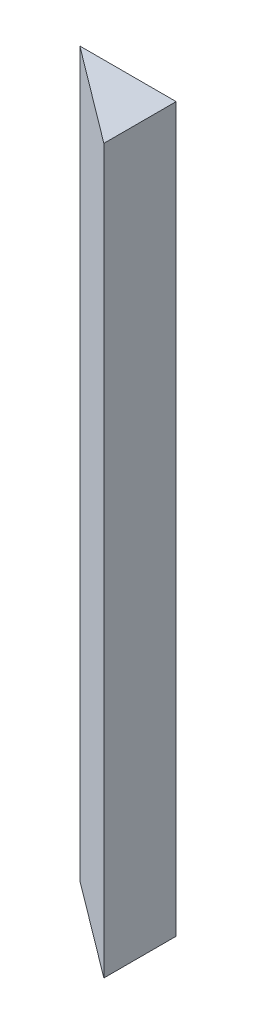
ISO-10303-21;
HEADER;
FILE_DESCRIPTION(('STEP AP214'),'2;1');
FILE_NAME('part.step','',(''),(''),'','','');
FILE_SCHEMA(('AUTOMOTIVE_DESIGN { 1 0 10303 214 1 1 1 1 }'));
ENDSEC;
DATA;
#1=APPLICATION_CONTEXT('core data for automotive mechanical design processes');
#2=APPLICATION_PROTOCOL_DEFINITION('international standard','automotive_design',2000,#1);
#3=PRODUCT_CONTEXT('',#1,'mechanical');
#4=PRODUCT('Part','Part','',(#3));
#5=PRODUCT_RELATED_PRODUCT_CATEGORY('part','',(#4));
#6=PRODUCT_DEFINITION_FORMATION('','',#4);
#7=PRODUCT_DEFINITION_CONTEXT('part definition',#1,'design');
#8=PRODUCT_DEFINITION('design','',#6,#7);
#9=PRODUCT_DEFINITION_SHAPE('','',#8);
#10=(LENGTH_UNIT() NAMED_UNIT(*) SI_UNIT(.MILLI.,.METRE.));
#11=(NAMED_UNIT(*) PLANE_ANGLE_UNIT() SI_UNIT($,.RADIAN.));
#12=(NAMED_UNIT(*) SI_UNIT($,.STERADIAN.) SOLID_ANGLE_UNIT());
#13=UNCERTAINTY_MEASURE_WITH_UNIT(LENGTH_MEASURE(1.E-05),#10,'distance_accuracy_value','');
#14=(GEOMETRIC_REPRESENTATION_CONTEXT(3) GLOBAL_UNCERTAINTY_ASSIGNED_CONTEXT((#13)) GLOBAL_UNIT_ASSIGNED_CONTEXT((#10,
#11,#12)) REPRESENTATION_CONTEXT('',''));
#15=CARTESIAN_POINT('',(0.,0.,0.));
#16=DIRECTION('',(0.,0.,1.));
#17=DIRECTION('',(1.,0.,0.));
#18=AXIS2_PLACEMENT_3D('',#15,#16,#17);
#19=CARTESIAN_POINT('',(3.90666097759886,-0.750000386406215,-2.35778256416098));
#20=DIRECTION('',(1.74845553146952E-07,1.,-8.74227765734759E-08));
#21=DIRECTION('',(-1.,1.74845553146952E-07,0.));
#22=AXIS2_PLACEMENT_3D('',#19,#20,#21);
#23=PLANE('',#22);
#24=DIRECTION('',(0.799759704949034,-8.73527640579341E-08,0.600320259811233));
#25=VECTOR('',#24,1.);
#26=CARTESIAN_POINT('',(3.76677769422186,-0.750000361365912,-2.35112145542898));
#27=LINE('',#26,#25);
#28=CARTESIAN_POINT('',(3.76677769422186,-0.750000361367912,-2.35112145542898));
#29=VERTEX_POINT('',#28);
#30=CARTESIAN_POINT('',(3.89999986886586,-0.750000375918939,-2.25112145542898));
#31=VERTEX_POINT('',#30);
#32=EDGE_CURVE('E11',#29,#31,#27,.T.);
#33=ORIENTED_EDGE('',*,*,#32,.T.);
#34=DIRECTION('',(0.,-8.74227767955201E-08,-0.999999999999996));
#35=VECTOR('',#34,1.);
#36=CARTESIAN_POINT('',(3.89999986886586,-0.750000375916939,-2.25112145542898));
#37=LINE('',#36,#35);
#38=CARTESIAN_POINT('',(3.89999986886586,-0.750000384661217,-2.35112145542898));
#39=VERTEX_POINT('',#38);
#40=EDGE_CURVE('E49',#31,#39,#37,.T.);
#41=ORIENTED_EDGE('',*,*,#40,.T.);
#42=DIRECTION('',(-0.999999999999985,1.74845553322982E-07,0.));
#43=VECTOR('',#42,1.);
#44=CARTESIAN_POINT('',(3.89999986886586,-0.750000384659217,-2.35112145542898));
#45=LINE('',#44,#43);
#46=EDGE_CURVE('E47',#39,#29,#45,.T.);
#47=ORIENTED_EDGE('',*,*,#46,.T.);
#48=EDGE_LOOP('',(#33,#41,#47));
#49=FACE_BOUND('',#48,.T.);
#50=ADVANCED_FACE('F17',(#49),#23,.T.);
#51=CARTESIAN_POINT('',(3.90666080275331,-1.75000038640721,-2.35778247673821));
#52=DIRECTION('',(1.74845553146952E-07,1.,-8.74227765734759E-08));
#53=DIRECTION('',(-1.,1.74845553146952E-07,0.));
#54=AXIS2_PLACEMENT_3D('',#51,#52,#53);
#55=PLANE('',#54);
#56=DIRECTION('',(-0.999999999999985,1.74845553322983E-07,0.));
#57=VECTOR('',#56,1.);
#58=CARTESIAN_POINT('',(3.89999969402031,-1.75000038466022,-2.35112136800621));
#59=LINE('',#58,#57);
#60=CARTESIAN_POINT('',(3.89999969402031,-1.75000038465922,-2.35112136800621));
#61=VERTEX_POINT('',#60);
#62=CARTESIAN_POINT('',(3.76677751937631,-1.75000036136591,-2.35112136800621));
#63=VERTEX_POINT('',#62);
#64=EDGE_CURVE('E24',#61,#63,#59,.T.);
#65=ORIENTED_EDGE('',*,*,#64,.F.);
#66=DIRECTION('',(0.,-8.74227756852966E-08,-0.999999999999996));
#67=VECTOR('',#66,1.);
#68=CARTESIAN_POINT('',(3.89999969402031,-1.75000037591794,-2.2511213680062));
#69=LINE('',#68,#67);
#70=CARTESIAN_POINT('',(3.89999969402031,-1.75000037591694,-2.2511213680062));
#71=VERTEX_POINT('',#70);
#72=EDGE_CURVE('E53',#71,#61,#69,.T.);
#73=ORIENTED_EDGE('',*,*,#72,.F.);
#74=DIRECTION('',(0.799759704949032,-8.73527633914448E-08,0.600320259811236));
#75=VECTOR('',#74,1.);
#76=CARTESIAN_POINT('',(3.76677751937631,-1.75000036136691,-2.35112136800621));
#77=LINE('',#76,#75);
#78=EDGE_CURVE('E68',#63,#71,#77,.T.);
#79=ORIENTED_EDGE('',*,*,#78,.F.);
#80=EDGE_LOOP('',(#65,#73,#79));
#81=FACE_BOUND('',#80,.T.);
#82=ADVANCED_FACE('F73',(#81),#55,.F.);
#83=CARTESIAN_POINT('',(3.76677769422186,-0.750000361365912,-2.35112145542898));
#84=DIRECTION('',(0.600320259811229,-1.74880541890246E-07,-0.799759704949033));
#85=DIRECTION('',(0.799759704949042,-8.73527640504488E-08,0.600320259811241));
#86=AXIS2_PLACEMENT_3D('',#83,#84,#85);
#87=PLANE('',#86);
#88=DIRECTION('',(-1.74845553146773E-07,-0.999999999999981,8.74227765733867E-08));
#89=VECTOR('',#88,1.);
#90=CARTESIAN_POINT('',(3.76677769422186,-0.750000361365912,-2.35112145542898));
#91=LINE('',#90,#89);
#92=EDGE_CURVE('E59',#29,#63,#91,.T.);
#93=ORIENTED_EDGE('',*,*,#92,.T.);
#94=ORIENTED_EDGE('',*,*,#78,.T.);
#95=DIRECTION('',(-1.74845553146773E-07,-0.999999999999981,8.74227765733867E-08));
#96=VECTOR('',#95,1.);
#97=CARTESIAN_POINT('',(3.89999986886586,-0.750000375916939,-2.25112145542898));
#98=LINE('',#97,#96);
#99=EDGE_CURVE('E54',#31,#71,#98,.T.);
#100=ORIENTED_EDGE('',*,*,#99,.F.);
#101=ORIENTED_EDGE('',*,*,#32,.F.);
#102=EDGE_LOOP('',(#93,#94,#100,#101));
#103=FACE_BOUND('',#102,.T.);
#104=ADVANCED_FACE('F57',(#103),#87,.F.);
#105=CARTESIAN_POINT('',(3.89999986886586,-0.750000375916939,-2.25112145542898));
#106=DIRECTION('',(-1.,1.74845553146952E-07,0.));
#107=DIRECTION('',(0.,-8.74227765734759E-08,-1.));
#108=AXIS2_PLACEMENT_3D('',#105,#106,#107);
#109=PLANE('',#108);
#110=ORIENTED_EDGE('',*,*,#99,.T.);
#111=ORIENTED_EDGE('',*,*,#72,.T.);
#112=DIRECTION('',(-1.74845553146774E-07,-0.999999999999981,8.74227765733868E-08));
#113=VECTOR('',#112,1.);
#114=CARTESIAN_POINT('',(3.89999986886586,-0.750000384659217,-2.35112145542898));
#115=LINE('',#114,#113);
#116=EDGE_CURVE('E70',#39,#61,#115,.T.);
#117=ORIENTED_EDGE('',*,*,#116,.F.);
#118=ORIENTED_EDGE('',*,*,#40,.F.);
#119=EDGE_LOOP('',(#110,#111,#117,#118));
#120=FACE_BOUND('',#119,.T.);
#121=ADVANCED_FACE('F72',(#120),#109,.F.);
#122=CARTESIAN_POINT('',(3.89999986886586,-0.750000384659217,-2.35112145542898));
#123=DIRECTION('',(0.,8.74227765734759E-08,1.));
#124=DIRECTION('',(-1.,1.74845553146952E-07,0.));
#125=AXIS2_PLACEMENT_3D('',#122,#123,#124);
#126=PLANE('',#125);
#127=ORIENTED_EDGE('',*,*,#116,.T.);
#128=ORIENTED_EDGE('',*,*,#64,.T.);
#129=ORIENTED_EDGE('',*,*,#92,.F.);
#130=ORIENTED_EDGE('',*,*,#46,.F.);
#131=EDGE_LOOP('',(#127,#128,#129,#130));
#132=FACE_BOUND('',#131,.T.);
#133=ADVANCED_FACE('F61',(#132),#126,.F.);
#134=CLOSED_SHELL('',(#50,#82,#104,#121,#133));
#135=MANIFOLD_SOLID_BREP('B1',#134);
#136=ADVANCED_BREP_SHAPE_REPRESENTATION('',(#18,#135),#14);
#137=SHAPE_DEFINITION_REPRESENTATION(#9,#136);
ENDSEC;
END-ISO-10303-21;
